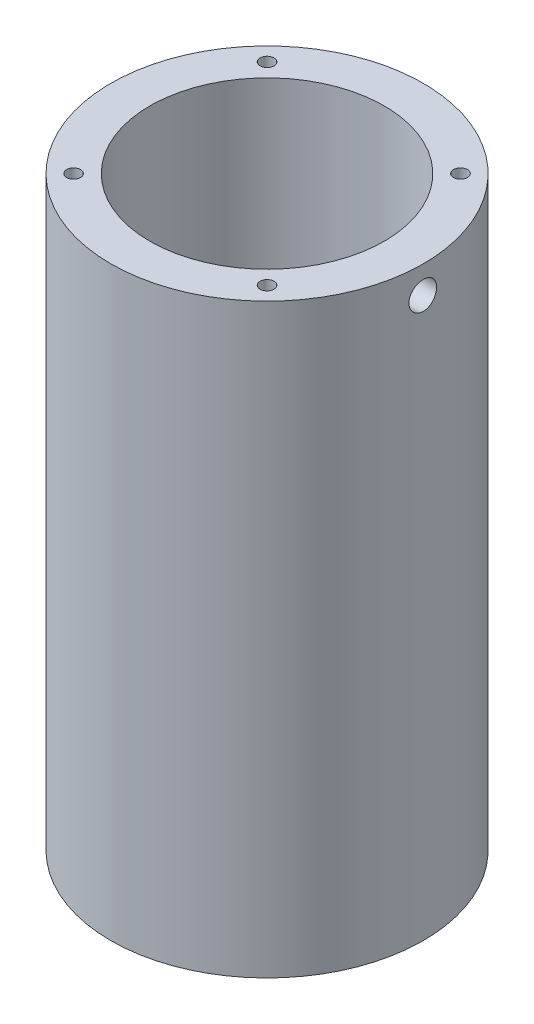
ISO-10303-21;
HEADER;
FILE_DESCRIPTION(('STEP AP214'),'2;1');
FILE_NAME('part.step','',(''),(''),'','','');
FILE_SCHEMA(('AUTOMOTIVE_DESIGN { 1 0 10303 214 1 1 1 1 }'));
ENDSEC;
DATA;
#1=APPLICATION_CONTEXT('core data for automotive mechanical design processes');
#2=APPLICATION_PROTOCOL_DEFINITION('international standard','automotive_design',2000,#1);
#3=PRODUCT_CONTEXT('',#1,'mechanical');
#4=PRODUCT('Part','Part','',(#3));
#5=PRODUCT_RELATED_PRODUCT_CATEGORY('part','',(#4));
#6=PRODUCT_DEFINITION_FORMATION('','',#4);
#7=PRODUCT_DEFINITION_CONTEXT('part definition',#1,'design');
#8=PRODUCT_DEFINITION('design','',#6,#7);
#9=PRODUCT_DEFINITION_SHAPE('','',#8);
#10=(LENGTH_UNIT() NAMED_UNIT(*) SI_UNIT(.MILLI.,.METRE.));
#11=(NAMED_UNIT(*) PLANE_ANGLE_UNIT() SI_UNIT($,.RADIAN.));
#12=(NAMED_UNIT(*) SI_UNIT($,.STERADIAN.) SOLID_ANGLE_UNIT());
#13=UNCERTAINTY_MEASURE_WITH_UNIT(LENGTH_MEASURE(1.E-05),#10,'distance_accuracy_value','');
#14=(GEOMETRIC_REPRESENTATION_CONTEXT(3) GLOBAL_UNCERTAINTY_ASSIGNED_CONTEXT((#13)) GLOBAL_UNIT_ASSIGNED_CONTEXT((#10,
#11,#12)) REPRESENTATION_CONTEXT('',''));
#15=CARTESIAN_POINT('',(0.,0.,0.));
#16=DIRECTION('',(0.,0.,1.));
#17=DIRECTION('',(1.,0.,0.));
#18=AXIS2_PLACEMENT_3D('',#15,#16,#17);
#19=CARTESIAN_POINT('',(0.,95.25,0.));
#20=DIRECTION('',(0.,1.,0.));
#21=DIRECTION('',(0.,0.,1.));
#22=AXIS2_PLACEMENT_3D('',#19,#20,#21);
#23=PLANE('',#22);
#24=CARTESIAN_POINT('',(-15.715448211871,95.25,-15.715448211871));
#25=DIRECTION('',(0.,1.,0.));
#26=DIRECTION('',(0.,0.,1.));
#27=AXIS2_PLACEMENT_3D('',#24,#25,#26);
#28=CIRCLE('',#27,1.1303);
#29=CARTESIAN_POINT('',(-15.715448211871,95.25,-14.585148211871));
#30=VERTEX_POINT('',#29);
#31=EDGE_CURVE('E88',#30,#30,#28,.T.);
#32=ORIENTED_EDGE('',*,*,#31,.F.);
#33=EDGE_LOOP('',(#32));
#34=FACE_BOUND('',#33,.T.);
#35=CARTESIAN_POINT('',(-15.715448211871,95.25,15.715448211871));
#36=DIRECTION('',(0.,1.,0.));
#37=DIRECTION('',(0.,0.,1.));
#38=AXIS2_PLACEMENT_3D('',#35,#36,#37);
#39=CIRCLE('',#38,1.1303);
#40=CARTESIAN_POINT('',(-15.715448211871,95.25,16.845748211871));
#41=VERTEX_POINT('',#40);
#42=EDGE_CURVE('E87',#41,#41,#39,.T.);
#43=ORIENTED_EDGE('',*,*,#42,.F.);
#44=EDGE_LOOP('',(#43));
#45=FACE_BOUND('',#44,.T.);
#46=CARTESIAN_POINT('',(15.715448211871,95.25,15.715448211871));
#47=DIRECTION('',(0.,1.,0.));
#48=DIRECTION('',(0.,0.,1.));
#49=AXIS2_PLACEMENT_3D('',#46,#47,#48);
#50=CIRCLE('',#49,1.1303);
#51=CARTESIAN_POINT('',(15.715448211871,95.25,16.845748211871));
#52=VERTEX_POINT('',#51);
#53=EDGE_CURVE('E100',#52,#52,#50,.T.);
#54=ORIENTED_EDGE('',*,*,#53,.F.);
#55=EDGE_LOOP('',(#54));
#56=FACE_BOUND('',#55,.T.);
#57=CARTESIAN_POINT('',(15.715448211871,95.25,-15.715448211871));
#58=DIRECTION('',(0.,1.,0.));
#59=DIRECTION('',(0.,0.,1.));
#60=AXIS2_PLACEMENT_3D('',#57,#58,#59);
#61=CIRCLE('',#60,1.1303);
#62=CARTESIAN_POINT('',(15.715448211871,95.25,-14.585148211871));
#63=VERTEX_POINT('',#62);
#64=EDGE_CURVE('E106',#63,#63,#61,.T.);
#65=ORIENTED_EDGE('',*,*,#64,.F.);
#66=EDGE_LOOP('',(#65));
#67=FACE_BOUND('',#66,.T.);
#68=CARTESIAN_POINT('',(0.,95.25,0.));
#69=DIRECTION('',(0.,1.,0.));
#70=DIRECTION('',(0.,0.,1.));
#71=AXIS2_PLACEMENT_3D('',#68,#69,#70);
#72=CIRCLE('',#71,25.4);
#73=CARTESIAN_POINT('',(0.,95.25,25.4));
#74=VERTEX_POINT('',#73);
#75=EDGE_CURVE('E52',#74,#74,#72,.T.);
#76=ORIENTED_EDGE('',*,*,#75,.T.);
#77=EDGE_LOOP('',(#76));
#78=FACE_BOUND('',#77,.T.);
#79=CARTESIAN_POINT('',(0.,95.25,0.));
#80=DIRECTION('',(0.,1.,0.));
#81=DIRECTION('',(0.,0.,1.));
#82=AXIS2_PLACEMENT_3D('',#79,#80,#81);
#83=CIRCLE('',#82,19.05);
#84=CARTESIAN_POINT('',(0.,95.25,19.05));
#85=VERTEX_POINT('',#84);
#86=EDGE_CURVE('E137',#85,#85,#83,.T.);
#87=ORIENTED_EDGE('',*,*,#86,.F.);
#88=EDGE_LOOP('',(#87));
#89=FACE_BOUND('',#88,.T.);
#90=ADVANCED_FACE('F40',(#34,#45,#56,#67,#78,#89),#23,.T.);
#91=CARTESIAN_POINT('',(0.,0.,0.));
#92=DIRECTION('',(0.,1.,0.));
#93=DIRECTION('',(0.,0.,1.));
#94=AXIS2_PLACEMENT_3D('',#91,#92,#93);
#95=PLANE('',#94);
#96=CARTESIAN_POINT('',(-15.715448211871,0.,-15.715448211871));
#97=DIRECTION('',(0.,-1.,0.));
#98=DIRECTION('',(0.,0.,-1.));
#99=AXIS2_PLACEMENT_3D('',#96,#97,#98);
#100=CIRCLE('',#99,1.1303);
#101=CARTESIAN_POINT('',(-15.715448211871,0.,-16.845748211871));
#102=VERTEX_POINT('',#101);
#103=EDGE_CURVE('E112',#102,#102,#100,.T.);
#104=ORIENTED_EDGE('',*,*,#103,.F.);
#105=EDGE_LOOP('',(#104));
#106=FACE_BOUND('',#105,.T.);
#107=CARTESIAN_POINT('',(-15.715448211871,0.,15.715448211871));
#108=DIRECTION('',(0.,-1.,0.));
#109=DIRECTION('',(0.,0.,-1.));
#110=AXIS2_PLACEMENT_3D('',#107,#108,#109);
#111=CIRCLE('',#110,1.1303);
#112=CARTESIAN_POINT('',(-15.715448211871,0.,14.585148211871));
#113=VERTEX_POINT('',#112);
#114=EDGE_CURVE('E118',#113,#113,#111,.T.);
#115=ORIENTED_EDGE('',*,*,#114,.F.);
#116=EDGE_LOOP('',(#115));
#117=FACE_BOUND('',#116,.T.);
#118=CARTESIAN_POINT('',(15.715448211871,0.,15.715448211871));
#119=DIRECTION('',(0.,-1.,0.));
#120=DIRECTION('',(0.,0.,-1.));
#121=AXIS2_PLACEMENT_3D('',#118,#119,#120);
#122=CIRCLE('',#121,1.1303);
#123=CARTESIAN_POINT('',(15.715448211871,0.,14.585148211871));
#124=VERTEX_POINT('',#123);
#125=EDGE_CURVE('E124',#124,#124,#122,.T.);
#126=ORIENTED_EDGE('',*,*,#125,.F.);
#127=EDGE_LOOP('',(#126));
#128=FACE_BOUND('',#127,.T.);
#129=CARTESIAN_POINT('',(15.715448211871,0.,-15.715448211871));
#130=DIRECTION('',(0.,-1.,0.));
#131=DIRECTION('',(0.,0.,-1.));
#132=AXIS2_PLACEMENT_3D('',#129,#130,#131);
#133=CIRCLE('',#132,1.1303);
#134=CARTESIAN_POINT('',(15.715448211871,0.,-16.845748211871));
#135=VERTEX_POINT('',#134);
#136=EDGE_CURVE('E130',#135,#135,#133,.T.);
#137=ORIENTED_EDGE('',*,*,#136,.F.);
#138=EDGE_LOOP('',(#137));
#139=FACE_BOUND('',#138,.T.);
#140=CARTESIAN_POINT('',(0.,0.,0.));
#141=DIRECTION('',(0.,1.,0.));
#142=DIRECTION('',(0.,0.,1.));
#143=AXIS2_PLACEMENT_3D('',#140,#141,#142);
#144=CIRCLE('',#143,25.4);
#145=CARTESIAN_POINT('',(0.,0.,25.4));
#146=VERTEX_POINT('',#145);
#147=EDGE_CURVE('E140',#146,#146,#144,.T.);
#148=ORIENTED_EDGE('',*,*,#147,.F.);
#149=EDGE_LOOP('',(#148));
#150=FACE_BOUND('',#149,.T.);
#151=CARTESIAN_POINT('',(0.,0.,0.));
#152=DIRECTION('',(0.,1.,0.));
#153=DIRECTION('',(0.,0.,1.));
#154=AXIS2_PLACEMENT_3D('',#151,#152,#153);
#155=CIRCLE('',#154,19.05);
#156=CARTESIAN_POINT('',(0.,0.,19.05));
#157=VERTEX_POINT('',#156);
#158=EDGE_CURVE('E136',#157,#157,#155,.T.);
#159=ORIENTED_EDGE('',*,*,#158,.T.);
#160=EDGE_LOOP('',(#159));
#161=FACE_BOUND('',#160,.T.);
#162=ADVANCED_FACE('F148',(#106,#117,#128,#139,#150,#161),#95,.F.);
#163=CARTESIAN_POINT('',(0.,95.25,0.));
#164=DIRECTION('',(0.,-1.,0.));
#165=DIRECTION('',(0.,0.,-1.));
#166=AXIS2_PLACEMENT_3D('',#163,#164,#165);
#167=CYLINDRICAL_SURFACE('',#166,25.4);
#168=CARTESIAN_POINT('',(25.4,88.5571,0.));
#169=CARTESIAN_POINT('',(25.3999987026399,88.5571054903813,0.126001066561644));
#170=CARTESIAN_POINT('',(25.3990524394963,88.5677297119796,0.252087191989198));
#171=CARTESIAN_POINT('',(25.395368591628,88.6099542473332,0.500768845327274));
#172=CARTESIAN_POINT('',(25.3926289937527,88.6415781353431,0.623360288611764));
#173=CARTESIAN_POINT('',(25.3856679666046,88.7248785521542,0.861415050472121));
#174=CARTESIAN_POINT('',(25.3814473923887,88.776543511849,0.976882437059305));
#175=CARTESIAN_POINT('',(25.3719973254644,88.8984382703264,1.19747936926634));
#176=CARTESIAN_POINT('',(25.3667680442035,88.9686641794598,1.30261107451531));
#177=CARTESIAN_POINT('',(25.3558703693246,89.125903383763,1.49987933930078));
#178=CARTESIAN_POINT('',(25.3502008968775,89.2129587551448,1.59198230402676));
#179=CARTESIAN_POINT('',(25.339070837661,89.4012964962621,1.76029021492846));
#180=CARTESIAN_POINT('',(25.3336102602146,89.5025795000308,1.83649445222485));
#181=CARTESIAN_POINT('',(25.3235048562271,89.7167031323432,1.97095720857969));
#182=CARTESIAN_POINT('',(25.3188613902967,89.8295625519291,2.0291859150806));
#183=CARTESIAN_POINT('',(25.3109286627206,90.063504591617,2.12585430210848));
#184=CARTESIAN_POINT('',(25.3076393743971,90.1845870496673,2.164294372483));
#185=CARTESIAN_POINT('',(25.3027967306497,90.4311994253191,2.22019615873773));
#186=CARTESIAN_POINT('',(25.3012388192045,90.5567167693228,2.23771294221629));
#187=CARTESIAN_POINT('',(25.3000210099688,90.8089189331801,2.25144106829994));
#188=CARTESIAN_POINT('',(25.3003610724187,90.9356037285219,2.24765285721093));
#189=CARTESIAN_POINT('',(25.302896640861,91.1861666591524,2.21892400148939));
#190=CARTESIAN_POINT('',(25.3050868900492,91.3100517262552,2.19404328478145));
#191=CARTESIAN_POINT('',(25.3110678116874,91.5518805430321,2.12392883568531));
#192=CARTESIAN_POINT('',(25.3148585015171,91.6698242281707,2.07869488227306));
#193=CARTESIAN_POINT('',(25.3236192410935,91.8966127878493,1.96909116375795));
#194=CARTESIAN_POINT('',(25.3285909405698,92.0054446440267,1.90469459868595));
#195=CARTESIAN_POINT('',(25.3391520315741,92.2107778172899,1.75861293988685));
#196=CARTESIAN_POINT('',(25.3447414372315,92.307278852212,1.6769274506541));
#197=CARTESIAN_POINT('',(25.3559315550202,92.4855594612426,1.49825098461916));
#198=CARTESIAN_POINT('',(25.3615322397025,92.5672871380396,1.40120821478763));
#199=CARTESIAN_POINT('',(25.3720955519848,92.7132995368868,1.1947523207084));
#200=CARTESIAN_POINT('',(25.3770581790833,92.777584245226,1.08533918673716));
#201=CARTESIAN_POINT('',(25.3857873580667,92.8868830036562,0.857214021765363));
#202=CARTESIAN_POINT('',(25.3895537612377,92.9318946579744,0.738500836873115));
#203=CARTESIAN_POINT('',(25.3954644794448,93.0013327642181,0.495161311384258));
#204=CARTESIAN_POINT('',(25.3976088324538,93.0257596980421,0.370535109286413));
#205=CARTESIAN_POINT('',(25.4000289666945,93.053269681104,0.119356948750066));
#206=CARTESIAN_POINT('',(25.4003110217075,93.0564243937847,-0.00718710295961701));
#207=CARTESIAN_POINT('',(25.3989915556,93.041488259197,-0.259003917197433));
#208=CARTESIAN_POINT('',(25.3973900543313,93.023397635843,-0.384276693110094));
#209=CARTESIAN_POINT('',(25.3924875694823,92.9665437692545,-0.629789856542573));
#210=CARTESIAN_POINT('',(25.3891893250221,92.9278138412632,-0.750038018235285));
#211=CARTESIAN_POINT('',(25.3812637201766,92.8308148539619,-0.982329607062807));
#212=CARTESIAN_POINT('',(25.3766363361917,92.7725454477142,-1.09437288847095));
#213=CARTESIAN_POINT('',(25.3665552114518,92.6379421557136,-1.30739973337547));
#214=CARTESIAN_POINT('',(25.3610993178498,92.5615609079915,-1.40835326722965));
#215=CARTESIAN_POINT('',(25.3499810486425,92.3929703845518,-1.59603154055069));
#216=CARTESIAN_POINT('',(25.3443186689912,92.3007607985541,-1.68275600102232));
#217=CARTESIAN_POINT('',(25.3334069498906,92.1028196123427,-1.83976103228138));
#218=CARTESIAN_POINT('',(25.3281588145127,91.9970507808481,-1.90999475975571));
#219=CARTESIAN_POINT('',(25.3186872577693,91.7751783215986,-2.0317032180889));
#220=CARTESIAN_POINT('',(25.3144638250581,91.659074808292,-2.08317815665393));
#221=CARTESIAN_POINT('',(25.3075268782808,91.4199930840942,-2.16582845666971));
#222=CARTESIAN_POINT('',(25.3048112494866,91.2970247691775,-2.19703225933769));
#223=CARTESIAN_POINT('',(25.3011904750048,91.0475690987733,-2.23834703551454));
#224=CARTESIAN_POINT('',(25.3002852895914,90.9210818205621,-2.24845847184208));
#225=CARTESIAN_POINT('',(25.3003885518817,90.6686442674322,-2.24729583583696));
#226=CARTESIAN_POINT('',(25.3013904141061,90.5426936443504,-2.23609535855217));
#227=CARTESIAN_POINT('',(25.3051808812811,90.2944700912537,-2.19278054267103));
#228=CARTESIAN_POINT('',(25.3079694887692,90.1721971664624,-2.16066617437116));
#229=CARTESIAN_POINT('',(25.3150174818226,89.9347966915897,-2.07645433102812));
#230=CARTESIAN_POINT('',(25.319276751245,89.8196685781072,-2.02435843395244));
#231=CARTESIAN_POINT('',(25.3287863707595,89.5997799787668,-1.90167035032984));
#232=CARTESIAN_POINT('',(25.3340367082204,89.4950193607999,-1.8310783995129));
#233=CARTESIAN_POINT('',(25.3449585061524,89.2984626110087,-1.67312536362444));
#234=CARTESIAN_POINT('',(25.3506313006959,89.2067104573415,-1.58570964408239));
#235=CARTESIAN_POINT('',(25.3617466219232,89.0391414758614,-1.39669298206979));
#236=CARTESIAN_POINT('',(25.3671890927286,88.9633284975172,-1.29508862273978));
#237=CARTESIAN_POINT('',(25.3772416216459,88.829674483386,-1.08035901695634));
#238=CARTESIAN_POINT('',(25.3818499511075,88.7718705944035,-0.967210588350999));
#239=CARTESIAN_POINT('',(25.3896952071711,88.6761568773358,-0.732848932453282));
#240=CARTESIAN_POINT('',(25.3929337006196,88.6382243081167,-0.611645103793711));
#241=CARTESIAN_POINT('',(25.396848134356,88.5929321140433,-0.408112060109971));
#242=CARTESIAN_POINT('',(25.3980246653696,88.5795130753674,-0.327089610696882));
#243=CARTESIAN_POINT('',(25.3996010193949,88.561595244452,-0.164056793965771));
#244=CARTESIAN_POINT('',(25.4000008447846,88.5570964249018,-0.0820464296731777));
#245=CARTESIAN_POINT('',(25.4,88.5571,0.));
#246=B_SPLINE_CURVE_WITH_KNOTS('',3,(#168,#169,#170,#171,#172,#173,#174,#175,#176,#177,#178,
#179,#180,#181,#182,#183,#184,#185,#186,#187,#188,#189,#190,#191,#192,#193,#194,#195,#196,#197,
#198,#199,#200,#201,#202,#203,#204,#205,#206,#207,#208,#209,#210,#211,#212,#213,#214,#215,#216,
#217,#218,#219,#220,#221,#222,#223,#224,#225,#226,#227,#228,#229,#230,#231,#232,#233,#234,#235,
#236,#237,#238,#239,#240,#241,#242,#243,#244,#245),.UNSPECIFIED.,.T.,.F.,(4,2,2,2,2,2,2,2,2,2,2,
2,2,2,2,2,2,2,2,2,2,2,2,2,2,2,2,2,2,2,2,2,2,2,2,2,2,2,4),(0.,0.377703627983838,
0.755831985017156,1.13374238401397,1.51157365047284,1.8903620632972,2.26916736161904,
2.64859757744732,3.02802031799532,3.40644224718137,3.78485624905688,4.16219869238135,
4.53954523351924,4.91742201496791,5.29530744175236,5.67449558276346,6.05368402183154,
6.43291958295066,6.81214626573396,7.19009474033929,7.56803923160668,7.94537549782391,
8.32271846427633,8.70105927070972,9.07940749453891,9.45881778632796,9.83822387697957,
10.2170964893612,10.5959607882534,10.9735191536082,11.3510780552015,11.728607146611,
12.1061314266914,12.4849030437983,12.8637660331884,13.2434053957517,13.6226093370669,
13.8685543109877,14.1144985319084),.UNSPECIFIED.);
#247=CARTESIAN_POINT('',(25.4,88.5571,0.));
#248=VERTEX_POINT('',#247);
#249=EDGE_CURVE('E12',#248,#248,#246,.T.);
#250=ORIENTED_EDGE('',*,*,#249,.T.);
#251=EDGE_LOOP('',(#250));
#252=FACE_BOUND('',#251,.T.);
#253=ORIENTED_EDGE('',*,*,#75,.F.);
#254=EDGE_LOOP('',(#253));
#255=FACE_BOUND('',#254,.T.);
#256=ORIENTED_EDGE('',*,*,#147,.T.);
#257=EDGE_LOOP('',(#256));
#258=FACE_BOUND('',#257,.T.);
#259=ADVANCED_FACE('F42',(#252,#255,#258),#167,.T.);
#260=CARTESIAN_POINT('',(0.,95.25,0.));
#261=DIRECTION('',(0.,-1.,0.));
#262=DIRECTION('',(0.,0.,-1.));
#263=AXIS2_PLACEMENT_3D('',#260,#261,#262);
#264=CYLINDRICAL_SURFACE('',#263,19.05);
#265=CARTESIAN_POINT('',(18.9169089861425,90.805,2.2479));
#266=CARTESIAN_POINT('',(18.9169107029297,90.9307930391275,2.24789461916045));
#267=CARTESIAN_POINT('',(18.9181772674065,91.0566660783047,2.23730527588855));
#268=CARTESIAN_POINT('',(18.9231051303489,91.3049130833101,2.19522746014724));
#269=CARTESIAN_POINT('',(18.9267689724687,91.4272831882046,2.16371678838006));
#270=CARTESIAN_POINT('',(18.9360707439183,91.6648939366607,2.08073472209794));
#271=CARTESIAN_POINT('',(18.9417073764639,91.7801392052151,2.02927643746252));
#272=CARTESIAN_POINT('',(18.9543180522315,92.0003356099417,1.90788709940905));
#273=CARTESIAN_POINT('',(18.961291855624,92.1052885870029,1.8379593577497));
#274=CARTESIAN_POINT('',(18.9758301812873,92.3024688054474,1.6812410512539));
#275=CARTESIAN_POINT('',(18.9833972016614,92.3946371450482,1.59437660107301));
#276=CARTESIAN_POINT('',(18.99824682797,92.5631234233047,1.40640943212952));
#277=CARTESIAN_POINT('',(19.005529420092,92.6394405929719,1.30530602299081));
#278=CARTESIAN_POINT('',(19.0190149856503,92.7742674715939,1.09136306779637));
#279=CARTESIAN_POINT('',(19.0252147226331,92.8327241762834,0.978489897086067));
#280=CARTESIAN_POINT('',(19.0358086492069,92.9298313919828,0.74444361659084));
#281=CARTESIAN_POINT('',(19.0402028988321,92.9684825615553,0.623270782933634));
#282=CARTESIAN_POINT('',(19.046673158188,93.0247063882498,0.376665525793708));
#283=CARTESIAN_POINT('',(19.0487599042707,93.0423766937216,0.251255651460667));
#284=CARTESIAN_POINT('',(19.0504166587528,93.0564396781259,-0.000765691765376979));
#285=CARTESIAN_POINT('',(19.0499867559808,93.0528331080541,-0.127377118090509));
#286=CARTESIAN_POINT('',(19.0466673671851,93.0245232777198,-0.377543613925909));
#287=CARTESIAN_POINT('',(19.043790124364,92.9999250296099,-0.501110752281193));
#288=CARTESIAN_POINT('',(19.0359131790722,92.9304940838033,-0.742350676345831));
#289=CARTESIAN_POINT('',(19.0309134400095,92.8856610372571,-0.860023360395453));
#290=CARTESIAN_POINT('',(19.0193322741102,92.776920423271,-1.08646096779008));
#291=CARTESIAN_POINT('',(19.0127470607843,92.7129671023072,-1.19520371770714));
#292=CARTESIAN_POINT('',(18.9987323568473,92.5678346016027,-1.40045274852353));
#293=CARTESIAN_POINT('',(18.9913028317281,92.48665471767,-1.49695852893908));
#294=CARTESIAN_POINT('',(18.9763782388449,92.308784589145,-1.67561056236559));
#295=CARTESIAN_POINT('',(18.9688830475125,92.2120028744791,-1.7576657622634));
#296=CARTESIAN_POINT('',(18.9547166867775,92.0059914569478,-1.904380551923));
#297=CARTESIAN_POINT('',(18.9480455194777,91.8967617223208,-1.96904009729773));
#298=CARTESIAN_POINT('',(18.9362824504457,91.6688771407253,-2.07913162320619));
#299=CARTESIAN_POINT('',(18.9311911064564,91.5502189836623,-2.12455681527782));
#300=CARTESIAN_POINT('',(18.9231752525139,91.3068856841443,-2.19481207238039));
#301=CARTESIAN_POINT('',(18.9202506498536,91.1822107993664,-2.21964301856948));
#302=CARTESIAN_POINT('',(18.9169161297226,90.9311858202554,-2.24788538741578));
#303=CARTESIAN_POINT('',(18.9164911956765,90.8048503086641,-2.25142472078743));
#304=CARTESIAN_POINT('',(18.9181644407845,90.5533864343578,-2.23732041593557));
#305=CARTESIAN_POINT('',(18.9202625721474,90.428258048823,-2.21967717894676));
#306=CARTESIAN_POINT('',(18.9267318545646,90.1831405065209,-2.16381605464495));
#307=CARTESIAN_POINT('',(18.9310962103686,90.063137140238,-2.12565966378886));
#308=CARTESIAN_POINT('',(18.9416006856646,89.8312324218153,-2.02991849580227));
#309=CARTESIAN_POINT('',(18.9477408610764,89.7193313249515,-1.97233310685085));
#310=CARTESIAN_POINT('',(18.9611412278645,89.5062275909813,-1.83905229834477));
#311=CARTESIAN_POINT('',(18.9684065659438,89.4050779106109,-1.76327273163027));
#312=CARTESIAN_POINT('',(18.9832222849205,89.2168876075433,-1.59587412067786));
#313=CARTESIAN_POINT('',(18.9907726756711,89.1298474731054,-1.50425452852432));
#314=CARTESIAN_POINT('',(19.0053536616979,88.971900166739,-1.30721900203744));
#315=CARTESIAN_POINT('',(19.0123814332502,88.9010768630403,-1.2017355987859));
#316=CARTESIAN_POINT('',(19.0250834720888,88.7781529759014,-0.980296385619298));
#317=CARTESIAN_POINT('',(19.0307577640851,88.7260520506457,-0.864340766944392));
#318=CARTESIAN_POINT('',(19.0401009138534,88.6421914652863,-0.625531599154717));
#319=CARTESIAN_POINT('',(19.0437746118469,88.6103826782533,-0.502695498688009));
#320=CARTESIAN_POINT('',(19.0487226804335,88.5678493222913,-0.253379920246008));
#321=CARTESIAN_POINT('',(19.0499971468617,88.5571239112059,-0.126900588001056));
#322=CARTESIAN_POINT('',(19.0500028265431,88.5570763125503,0.125290821669739));
#323=CARTESIAN_POINT('',(19.0487494373211,88.5676245442236,0.251002894105325));
#324=CARTESIAN_POINT('',(19.0438707589116,88.6095511806932,0.498854816553492));
#325=CARTESIAN_POINT('',(19.0402454701787,88.6409295814985,0.620994667250487));
#326=CARTESIAN_POINT('',(19.031028683368,88.7235865449003,0.858222801436247));
#327=CARTESIAN_POINT('',(19.0254377283101,88.7748596119551,0.973313022101211));
#328=CARTESIAN_POINT('',(19.0129099419203,88.8958370087372,1.19327566193408));
#329=CARTESIAN_POINT('',(19.0059731016952,88.9655414602534,1.29814801357913));
#330=CARTESIAN_POINT('',(18.9914782443387,89.1218847017122,1.49536084393096));
#331=CARTESIAN_POINT('',(18.9839168363001,89.2086200054806,1.58762456437232));
#332=CARTESIAN_POINT('',(18.9690527664754,89.3963643043113,1.7563399003822));
#333=CARTESIAN_POINT('',(18.9617501666168,89.4973766871337,1.83278775241846));
#334=CARTESIAN_POINT('',(18.9482036661627,89.7112034593592,1.96792278051071));
#335=CARTESIAN_POINT('',(18.9419635065952,89.8240573793684,2.02654774599168));
#336=CARTESIAN_POINT('',(18.9312924003526,90.0580159416069,2.12393259836651));
#337=CARTESIAN_POINT('',(18.9268594649181,90.1791113422526,2.16271433379749));
#338=CARTESIAN_POINT('',(18.921393730347,90.3848766942995,2.2099096224883));
#339=CARTESIAN_POINT('',(18.9197201976846,90.4682430377475,2.22413583892828));
#340=CARTESIAN_POINT('',(18.917477252625,90.6360608961458,2.24313280407113));
#341=CARTESIAN_POINT('',(18.9169078330802,90.7205124040675,2.24790361398532));
#342=CARTESIAN_POINT('',(18.9169089861425,90.805,2.2479));
#343=B_SPLINE_CURVE_WITH_KNOTS('',3,(#265,#266,#267,#268,#269,#270,#271,#272,#273,#274,#275,
#276,#277,#278,#279,#280,#281,#282,#283,#284,#285,#286,#287,#288,#289,#290,#291,#292,#293,#294,
#295,#296,#297,#298,#299,#300,#301,#302,#303,#304,#305,#306,#307,#308,#309,#310,#311,#312,#313,
#314,#315,#316,#317,#318,#319,#320,#321,#322,#323,#324,#325,#326,#327,#328,#329,#330,#331,#332,
#333,#334,#335,#336,#337,#338,#339,#340,#341,#342),.UNSPECIFIED.,.T.,.F.,(4,2,2,2,2,2,2,2,2,2,2,
2,2,2,2,2,2,2,2,2,2,2,2,2,2,2,2,2,2,2,2,2,2,2,2,2,2,2,4),(0.,0.377070505849819,
0.754541756171639,1.13176534600179,1.50892134172894,1.8877610355078,2.26661910366167,
2.64659082103714,3.02654990298299,3.40473357398192,3.78290389656208,4.15919341494059,
4.53548942082886,4.91269318451276,5.28991237060275,5.66942941340788,6.04894742458608,
6.42859926924966,6.80823486905633,7.18558748792788,7.56293295919766,7.939153442455,
8.3153857740354,8.69339286688911,9.07141303784334,9.45134614414178,9.83127231362909,
10.2102751621771,10.589262871495,10.9659490855952,11.3426352275244,11.7192173907149,
12.0958020423086,12.4745858221529,12.8534596336919,13.2336411051939,13.6134030693417,
13.866660220902,14.1199157329499),.UNSPECIFIED.);
#344=CARTESIAN_POINT('',(18.9169089861425,90.805,2.2479));
#345=VERTEX_POINT('',#344);
#346=EDGE_CURVE('E94',#345,#345,#343,.T.);
#347=ORIENTED_EDGE('',*,*,#346,.F.);
#348=EDGE_LOOP('',(#347));
#349=FACE_BOUND('',#348,.T.);
#350=ORIENTED_EDGE('',*,*,#86,.T.);
#351=EDGE_LOOP('',(#350));
#352=FACE_BOUND('',#351,.T.);
#353=ORIENTED_EDGE('',*,*,#158,.F.);
#354=EDGE_LOOP('',(#353));
#355=FACE_BOUND('',#354,.T.);
#356=ADVANCED_FACE('F154',(#349,#352,#355),#264,.F.);
#357=CARTESIAN_POINT('',(15.715448211871,8.255,-15.715448211871));
#358=DIRECTION('',(0.,-1.,0.));
#359=DIRECTION('',(0.,0.,-1.));
#360=AXIS2_PLACEMENT_3D('',#357,#358,#359);
#361=CONICAL_SURFACE('',#360,1.1303,1.02974425867665);
#362=CARTESIAN_POINT('',(15.715448211871,8.93415275768685,-15.715448211871));
#363=VERTEX_POINT('',#362);
#364=VERTEX_LOOP('',#363);
#365=FACE_BOUND('',#364,.T.);
#366=CARTESIAN_POINT('',(15.715448211871,8.255,-15.715448211871));
#367=DIRECTION('',(0.,-1.,0.));
#368=DIRECTION('',(0.,0.,-1.));
#369=AXIS2_PLACEMENT_3D('',#366,#367,#368);
#370=CIRCLE('',#369,1.1303);
#371=CARTESIAN_POINT('',(15.715448211871,8.255,-16.845748211871));
#372=VERTEX_POINT('',#371);
#373=EDGE_CURVE('E133',#372,#372,#370,.T.);
#374=ORIENTED_EDGE('',*,*,#373,.T.);
#375=EDGE_LOOP('',(#374));
#376=FACE_BOUND('',#375,.T.);
#377=ADVANCED_FACE('F156',(#365,#376),#361,.F.);
#378=CARTESIAN_POINT('',(15.715448211871,0.,-15.715448211871));
#379=DIRECTION('',(0.,-1.,0.));
#380=DIRECTION('',(0.,0.,-1.));
#381=AXIS2_PLACEMENT_3D('',#378,#379,#380);
#382=CYLINDRICAL_SURFACE('',#381,1.1303);
#383=ORIENTED_EDGE('',*,*,#373,.F.);
#384=EDGE_LOOP('',(#383));
#385=FACE_BOUND('',#384,.T.);
#386=ORIENTED_EDGE('',*,*,#136,.T.);
#387=EDGE_LOOP('',(#386));
#388=FACE_BOUND('',#387,.T.);
#389=ADVANCED_FACE('F163',(#385,#388),#382,.F.);
#390=CARTESIAN_POINT('',(15.715448211871,8.255,15.715448211871));
#391=DIRECTION('',(0.,-1.,0.));
#392=DIRECTION('',(0.,0.,-1.));
#393=AXIS2_PLACEMENT_3D('',#390,#391,#392);
#394=CONICAL_SURFACE('',#393,1.1303,1.02974425867665);
#395=CARTESIAN_POINT('',(15.715448211871,8.93415275768685,15.715448211871));
#396=VERTEX_POINT('',#395);
#397=VERTEX_LOOP('',#396);
#398=FACE_BOUND('',#397,.T.);
#399=CARTESIAN_POINT('',(15.715448211871,8.255,15.715448211871));
#400=DIRECTION('',(0.,-1.,0.));
#401=DIRECTION('',(0.,0.,-1.));
#402=AXIS2_PLACEMENT_3D('',#399,#400,#401);
#403=CIRCLE('',#402,1.1303);
#404=CARTESIAN_POINT('',(15.715448211871,8.255,14.585148211871));
#405=VERTEX_POINT('',#404);
#406=EDGE_CURVE('E127',#405,#405,#403,.T.);
#407=ORIENTED_EDGE('',*,*,#406,.T.);
#408=EDGE_LOOP('',(#407));
#409=FACE_BOUND('',#408,.T.);
#410=ADVANCED_FACE('F224',(#398,#409),#394,.F.);
#411=CARTESIAN_POINT('',(15.715448211871,0.,15.715448211871));
#412=DIRECTION('',(0.,-1.,0.));
#413=DIRECTION('',(0.,0.,-1.));
#414=AXIS2_PLACEMENT_3D('',#411,#412,#413);
#415=CYLINDRICAL_SURFACE('',#414,1.1303);
#416=ORIENTED_EDGE('',*,*,#406,.F.);
#417=EDGE_LOOP('',(#416));
#418=FACE_BOUND('',#417,.T.);
#419=ORIENTED_EDGE('',*,*,#125,.T.);
#420=EDGE_LOOP('',(#419));
#421=FACE_BOUND('',#420,.T.);
#422=ADVANCED_FACE('F220',(#418,#421),#415,.F.);
#423=CARTESIAN_POINT('',(-15.715448211871,8.255,15.715448211871));
#424=DIRECTION('',(0.,-1.,0.));
#425=DIRECTION('',(0.,0.,-1.));
#426=AXIS2_PLACEMENT_3D('',#423,#424,#425);
#427=CONICAL_SURFACE('',#426,1.1303,1.02974425867665);
#428=CARTESIAN_POINT('',(-15.715448211871,8.93415275768685,15.715448211871));
#429=VERTEX_POINT('',#428);
#430=VERTEX_LOOP('',#429);
#431=FACE_BOUND('',#430,.T.);
#432=CARTESIAN_POINT('',(-15.715448211871,8.255,15.715448211871));
#433=DIRECTION('',(0.,-1.,0.));
#434=DIRECTION('',(0.,0.,-1.));
#435=AXIS2_PLACEMENT_3D('',#432,#433,#434);
#436=CIRCLE('',#435,1.1303);
#437=CARTESIAN_POINT('',(-15.715448211871,8.255,14.585148211871));
#438=VERTEX_POINT('',#437);
#439=EDGE_CURVE('E121',#438,#438,#436,.T.);
#440=ORIENTED_EDGE('',*,*,#439,.T.);
#441=EDGE_LOOP('',(#440));
#442=FACE_BOUND('',#441,.T.);
#443=ADVANCED_FACE('F216',(#431,#442),#427,.F.);
#444=CARTESIAN_POINT('',(-15.715448211871,0.,15.715448211871));
#445=DIRECTION('',(0.,-1.,0.));
#446=DIRECTION('',(0.,0.,-1.));
#447=AXIS2_PLACEMENT_3D('',#444,#445,#446);
#448=CYLINDRICAL_SURFACE('',#447,1.1303);
#449=ORIENTED_EDGE('',*,*,#439,.F.);
#450=EDGE_LOOP('',(#449));
#451=FACE_BOUND('',#450,.T.);
#452=ORIENTED_EDGE('',*,*,#114,.T.);
#453=EDGE_LOOP('',(#452));
#454=FACE_BOUND('',#453,.T.);
#455=ADVANCED_FACE('F212',(#451,#454),#448,.F.);
#456=CARTESIAN_POINT('',(-15.715448211871,8.255,-15.715448211871));
#457=DIRECTION('',(0.,-1.,0.));
#458=DIRECTION('',(0.,0.,-1.));
#459=AXIS2_PLACEMENT_3D('',#456,#457,#458);
#460=CONICAL_SURFACE('',#459,1.1303,1.02974425867665);
#461=CARTESIAN_POINT('',(-15.715448211871,8.93415275768685,-15.715448211871));
#462=VERTEX_POINT('',#461);
#463=VERTEX_LOOP('',#462);
#464=FACE_BOUND('',#463,.T.);
#465=CARTESIAN_POINT('',(-15.715448211871,8.255,-15.715448211871));
#466=DIRECTION('',(0.,-1.,0.));
#467=DIRECTION('',(0.,0.,-1.));
#468=AXIS2_PLACEMENT_3D('',#465,#466,#467);
#469=CIRCLE('',#468,1.1303);
#470=CARTESIAN_POINT('',(-15.715448211871,8.255,-16.845748211871));
#471=VERTEX_POINT('',#470);
#472=EDGE_CURVE('E115',#471,#471,#469,.T.);
#473=ORIENTED_EDGE('',*,*,#472,.T.);
#474=EDGE_LOOP('',(#473));
#475=FACE_BOUND('',#474,.T.);
#476=ADVANCED_FACE('F208',(#464,#475),#460,.F.);
#477=CARTESIAN_POINT('',(-15.715448211871,0.,-15.715448211871));
#478=DIRECTION('',(0.,-1.,0.));
#479=DIRECTION('',(0.,0.,-1.));
#480=AXIS2_PLACEMENT_3D('',#477,#478,#479);
#481=CYLINDRICAL_SURFACE('',#480,1.1303);
#482=ORIENTED_EDGE('',*,*,#472,.F.);
#483=EDGE_LOOP('',(#482));
#484=FACE_BOUND('',#483,.T.);
#485=ORIENTED_EDGE('',*,*,#103,.T.);
#486=EDGE_LOOP('',(#485));
#487=FACE_BOUND('',#486,.T.);
#488=ADVANCED_FACE('F200',(#484,#487),#481,.F.);
#489=CARTESIAN_POINT('',(15.715448211871,86.995,-15.715448211871));
#490=DIRECTION('',(0.,1.,0.));
#491=DIRECTION('',(0.,0.,1.));
#492=AXIS2_PLACEMENT_3D('',#489,#490,#491);
#493=CONICAL_SURFACE('',#492,1.1303,1.02974425867665);
#494=CARTESIAN_POINT('',(15.715448211871,86.3158472423131,-15.715448211871));
#495=VERTEX_POINT('',#494);
#496=VERTEX_LOOP('',#495);
#497=FACE_BOUND('',#496,.T.);
#498=CARTESIAN_POINT('',(15.715448211871,86.995,-15.715448211871));
#499=DIRECTION('',(0.,1.,0.));
#500=DIRECTION('',(0.,0.,1.));
#501=AXIS2_PLACEMENT_3D('',#498,#499,#500);
#502=CIRCLE('',#501,1.1303);
#503=CARTESIAN_POINT('',(15.715448211871,86.995,-14.585148211871));
#504=VERTEX_POINT('',#503);
#505=EDGE_CURVE('E109',#504,#504,#502,.T.);
#506=ORIENTED_EDGE('',*,*,#505,.T.);
#507=EDGE_LOOP('',(#506));
#508=FACE_BOUND('',#507,.T.);
#509=ADVANCED_FACE('F190',(#497,#508),#493,.F.);
#510=CARTESIAN_POINT('',(15.715448211871,95.25,-15.715448211871));
#511=DIRECTION('',(0.,1.,0.));
#512=DIRECTION('',(0.,0.,1.));
#513=AXIS2_PLACEMENT_3D('',#510,#511,#512);
#514=CYLINDRICAL_SURFACE('',#513,1.1303);
#515=ORIENTED_EDGE('',*,*,#505,.F.);
#516=EDGE_LOOP('',(#515));
#517=FACE_BOUND('',#516,.T.);
#518=ORIENTED_EDGE('',*,*,#64,.T.);
#519=EDGE_LOOP('',(#518));
#520=FACE_BOUND('',#519,.T.);
#521=ADVANCED_FACE('F187',(#517,#520),#514,.F.);
#522=CARTESIAN_POINT('',(15.715448211871,86.995,15.715448211871));
#523=DIRECTION('',(0.,1.,0.));
#524=DIRECTION('',(0.,0.,1.));
#525=AXIS2_PLACEMENT_3D('',#522,#523,#524);
#526=CONICAL_SURFACE('',#525,1.1303,1.02974425867665);
#527=CARTESIAN_POINT('',(15.715448211871,86.3158472423131,15.715448211871));
#528=VERTEX_POINT('',#527);
#529=VERTEX_LOOP('',#528);
#530=FACE_BOUND('',#529,.T.);
#531=CARTESIAN_POINT('',(15.715448211871,86.995,15.715448211871));
#532=DIRECTION('',(0.,1.,0.));
#533=DIRECTION('',(0.,0.,1.));
#534=AXIS2_PLACEMENT_3D('',#531,#532,#533);
#535=CIRCLE('',#534,1.1303);
#536=CARTESIAN_POINT('',(15.715448211871,86.995,16.845748211871));
#537=VERTEX_POINT('',#536);
#538=EDGE_CURVE('E103',#537,#537,#535,.T.);
#539=ORIENTED_EDGE('',*,*,#538,.T.);
#540=EDGE_LOOP('',(#539));
#541=FACE_BOUND('',#540,.T.);
#542=ADVANCED_FACE('F189',(#530,#541),#526,.F.);
#543=CARTESIAN_POINT('',(15.715448211871,95.25,15.715448211871));
#544=DIRECTION('',(0.,1.,0.));
#545=DIRECTION('',(0.,0.,1.));
#546=AXIS2_PLACEMENT_3D('',#543,#544,#545);
#547=CYLINDRICAL_SURFACE('',#546,1.1303);
#548=ORIENTED_EDGE('',*,*,#538,.F.);
#549=EDGE_LOOP('',(#548));
#550=FACE_BOUND('',#549,.T.);
#551=ORIENTED_EDGE('',*,*,#53,.T.);
#552=EDGE_LOOP('',(#551));
#553=FACE_BOUND('',#552,.T.);
#554=ADVANCED_FACE('F197',(#550,#553),#547,.F.);
#555=CARTESIAN_POINT('',(-15.715448211871,86.995,15.715448211871));
#556=DIRECTION('',(0.,1.,0.));
#557=DIRECTION('',(0.,0.,1.));
#558=AXIS2_PLACEMENT_3D('',#555,#556,#557);
#559=CONICAL_SURFACE('',#558,1.1303,1.02974425867665);
#560=CARTESIAN_POINT('',(-15.715448211871,86.3158472423131,15.715448211871));
#561=VERTEX_POINT('',#560);
#562=VERTEX_LOOP('',#561);
#563=FACE_BOUND('',#562,.T.);
#564=CARTESIAN_POINT('',(-15.715448211871,86.995,15.715448211871));
#565=DIRECTION('',(0.,1.,0.));
#566=DIRECTION('',(0.,0.,1.));
#567=AXIS2_PLACEMENT_3D('',#564,#565,#566);
#568=CIRCLE('',#567,1.1303);
#569=CARTESIAN_POINT('',(-15.715448211871,86.995,16.845748211871));
#570=VERTEX_POINT('',#569);
#571=EDGE_CURVE('E91',#570,#570,#568,.T.);
#572=ORIENTED_EDGE('',*,*,#571,.T.);
#573=EDGE_LOOP('',(#572));
#574=FACE_BOUND('',#573,.T.);
#575=ADVANCED_FACE('F288',(#563,#574),#559,.F.);
#576=CARTESIAN_POINT('',(-15.715448211871,95.25,15.715448211871));
#577=DIRECTION('',(0.,1.,0.));
#578=DIRECTION('',(0.,0.,1.));
#579=AXIS2_PLACEMENT_3D('',#576,#577,#578);
#580=CYLINDRICAL_SURFACE('',#579,1.1303);
#581=ORIENTED_EDGE('',*,*,#571,.F.);
#582=EDGE_LOOP('',(#581));
#583=FACE_BOUND('',#582,.T.);
#584=ORIENTED_EDGE('',*,*,#42,.T.);
#585=EDGE_LOOP('',(#584));
#586=FACE_BOUND('',#585,.T.);
#587=ADVANCED_FACE('F81',(#583,#586),#580,.F.);
#588=CARTESIAN_POINT('',(-15.715448211871,86.995,-15.715448211871));
#589=DIRECTION('',(0.,1.,0.));
#590=DIRECTION('',(0.,0.,1.));
#591=AXIS2_PLACEMENT_3D('',#588,#589,#590);
#592=CONICAL_SURFACE('',#591,1.1303,1.02974425867665);
#593=CARTESIAN_POINT('',(-15.715448211871,86.3158472423131,-15.715448211871));
#594=VERTEX_POINT('',#593);
#595=VERTEX_LOOP('',#594);
#596=FACE_BOUND('',#595,.T.);
#597=CARTESIAN_POINT('',(-15.715448211871,86.995,-15.715448211871));
#598=DIRECTION('',(0.,1.,0.));
#599=DIRECTION('',(0.,0.,1.));
#600=AXIS2_PLACEMENT_3D('',#597,#598,#599);
#601=CIRCLE('',#600,1.1303);
#602=CARTESIAN_POINT('',(-15.715448211871,86.995,-14.585148211871));
#603=VERTEX_POINT('',#602);
#604=EDGE_CURVE('E85',#603,#603,#601,.T.);
#605=ORIENTED_EDGE('',*,*,#604,.T.);
#606=EDGE_LOOP('',(#605));
#607=FACE_BOUND('',#606,.T.);
#608=ADVANCED_FACE('F77',(#596,#607),#592,.F.);
#609=CARTESIAN_POINT('',(-15.715448211871,95.25,-15.715448211871));
#610=DIRECTION('',(0.,1.,0.));
#611=DIRECTION('',(0.,0.,1.));
#612=AXIS2_PLACEMENT_3D('',#609,#610,#611);
#613=CYLINDRICAL_SURFACE('',#612,1.1303);
#614=ORIENTED_EDGE('',*,*,#604,.F.);
#615=EDGE_LOOP('',(#614));
#616=FACE_BOUND('',#615,.T.);
#617=ORIENTED_EDGE('',*,*,#31,.T.);
#618=EDGE_LOOP('',(#617));
#619=FACE_BOUND('',#618,.T.);
#620=ADVANCED_FACE('F80',(#616,#619),#613,.F.);
#621=CARTESIAN_POINT('',(0.,90.805,0.));
#622=DIRECTION('',(-1.,0.,0.));
#623=DIRECTION('',(0.,0.,1.));
#624=AXIS2_PLACEMENT_3D('',#621,#622,#623);
#625=CYLINDRICAL_SURFACE('',#624,2.2479);
#626=ORIENTED_EDGE('',*,*,#346,.T.);
#627=EDGE_LOOP('',(#626));
#628=FACE_BOUND('',#627,.T.);
#629=ORIENTED_EDGE('',*,*,#249,.F.);
#630=EDGE_LOOP('',(#629));
#631=FACE_BOUND('',#630,.T.);
#632=ADVANCED_FACE('F321',(#628,#631),#625,.F.);
#633=CLOSED_SHELL('',(#90,#162,#259,#356,#377,#389,#410,#422,#443,#455,#476,#488,#509,#521,#542,
#554,#575,#587,#608,#620,#632));
#634=MANIFOLD_SOLID_BREP('B2',#633);
#635=ADVANCED_BREP_SHAPE_REPRESENTATION('',(#18,#634),#14);
#636=SHAPE_DEFINITION_REPRESENTATION(#9,#635);
ENDSEC;
END-ISO-10303-21;
